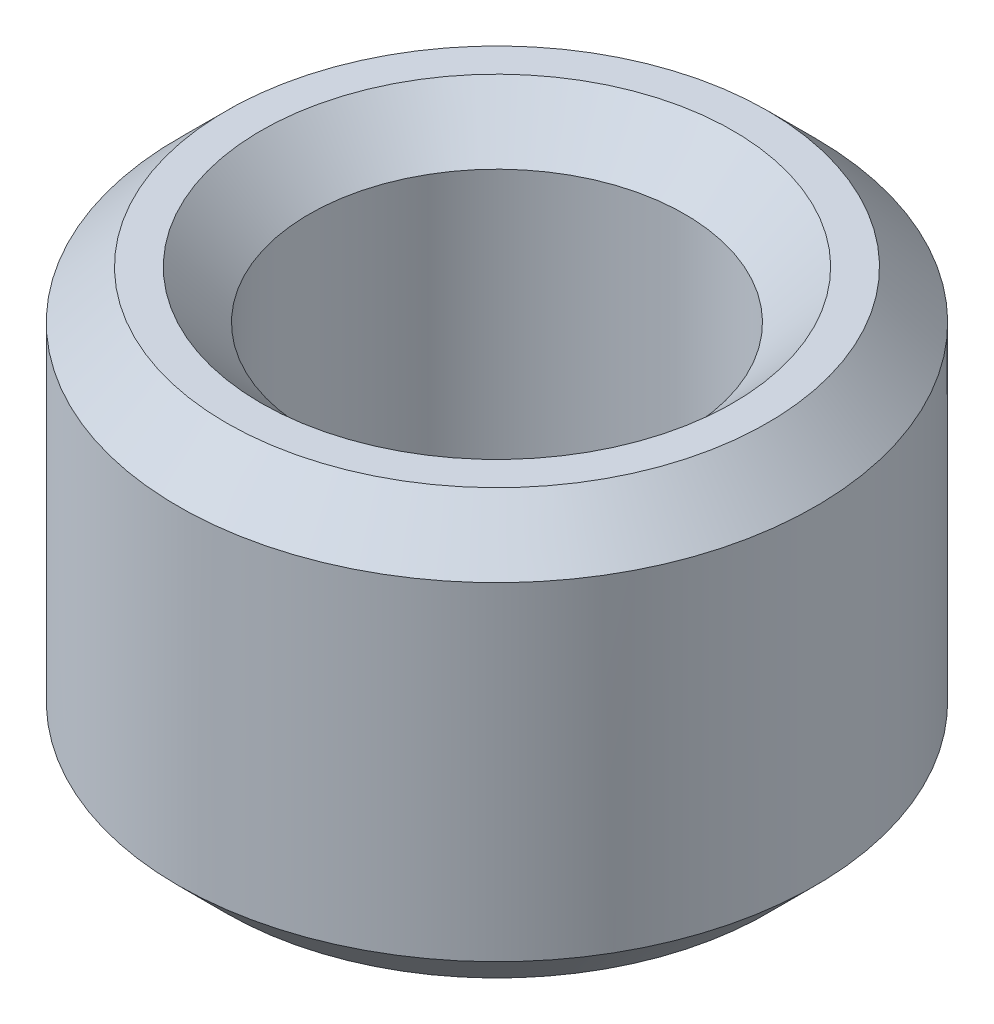
ISO-10303-21;
HEADER;
FILE_DESCRIPTION(('STEP AP214'),'2;1');
FILE_NAME('part.step','',(''),(''),'','','');
FILE_SCHEMA(('AUTOMOTIVE_DESIGN { 1 0 10303 214 1 1 1 1 }'));
ENDSEC;
DATA;
#1=APPLICATION_CONTEXT('core data for automotive mechanical design processes');
#2=APPLICATION_PROTOCOL_DEFINITION('international standard','automotive_design',2000,#1);
#3=PRODUCT_CONTEXT('',#1,'mechanical');
#4=PRODUCT('Part','Part','',(#3));
#5=PRODUCT_RELATED_PRODUCT_CATEGORY('part','',(#4));
#6=PRODUCT_DEFINITION_FORMATION('','',#4);
#7=PRODUCT_DEFINITION_CONTEXT('part definition',#1,'design');
#8=PRODUCT_DEFINITION('design','',#6,#7);
#9=PRODUCT_DEFINITION_SHAPE('','',#8);
#10=(LENGTH_UNIT() NAMED_UNIT(*) SI_UNIT(.MILLI.,.METRE.));
#11=(NAMED_UNIT(*) PLANE_ANGLE_UNIT() SI_UNIT($,.RADIAN.));
#12=(NAMED_UNIT(*) SI_UNIT($,.STERADIAN.) SOLID_ANGLE_UNIT());
#13=UNCERTAINTY_MEASURE_WITH_UNIT(LENGTH_MEASURE(1.E-05),#10,'distance_accuracy_value','');
#14=(GEOMETRIC_REPRESENTATION_CONTEXT(3) GLOBAL_UNCERTAINTY_ASSIGNED_CONTEXT((#13)) GLOBAL_UNIT_ASSIGNED_CONTEXT((#10,
#11,#12)) REPRESENTATION_CONTEXT('',''));
#15=CARTESIAN_POINT('',(0.,0.,0.));
#16=DIRECTION('',(0.,0.,1.));
#17=DIRECTION('',(1.,0.,0.));
#18=AXIS2_PLACEMENT_3D('',#15,#16,#17);
#19=CARTESIAN_POINT('',(0.,16.6556540120762,0.));
#20=DIRECTION('',(0.,-1.,0.));
#21=DIRECTION('',(0.,0.,-1.));
#22=AXIS2_PLACEMENT_3D('',#19,#20,#21);
#23=CYLINDRICAL_SURFACE('',#22,12.5);
#24=CARTESIAN_POINT('',(0.,1.89025978462281,0.));
#25=DIRECTION('',(0.,1.,0.));
#26=DIRECTION('',(0.,0.,1.));
#27=AXIS2_PLACEMENT_3D('',#24,#25,#26);
#28=CIRCLE('',#27,12.5);
#29=CARTESIAN_POINT('',(0.,1.89025978462281,12.5));
#30=VERTEX_POINT('',#29);
#31=EDGE_CURVE('E10',#30,#30,#28,.T.);
#32=ORIENTED_EDGE('',*,*,#31,.T.);
#33=EDGE_LOOP('',(#32));
#34=FACE_BOUND('',#33,.T.);
#35=CARTESIAN_POINT('',(0.,14.7653942274534,0.));
#36=DIRECTION('',(0.,1.,0.));
#37=DIRECTION('',(0.,0.,1.));
#38=AXIS2_PLACEMENT_3D('',#35,#36,#37);
#39=CIRCLE('',#38,12.5);
#40=CARTESIAN_POINT('',(0.,14.7653942274534,-12.5));
#41=VERTEX_POINT('',#40);
#42=EDGE_CURVE('E50',#41,#41,#39,.F.);
#43=ORIENTED_EDGE('',*,*,#42,.T.);
#44=EDGE_LOOP('',(#43));
#45=FACE_BOUND('',#44,.T.);
#46=ADVANCED_FACE('F39',(#34,#45),#23,.T.);
#47=CARTESIAN_POINT('',(0.,16.6556540120762,0.));
#48=DIRECTION('',(0.,1.,0.));
#49=DIRECTION('',(0.,0.,1.));
#50=AXIS2_PLACEMENT_3D('',#47,#48,#49);
#51=PLANE('',#50);
#52=CARTESIAN_POINT('',(0.,16.6556540120762,0.));
#53=DIRECTION('',(0.,1.,0.));
#54=DIRECTION('',(0.,0.,1.));
#55=AXIS2_PLACEMENT_3D('',#52,#53,#54);
#56=CIRCLE('',#55,9.25492308203139);
#57=CARTESIAN_POINT('',(0.,16.6556540120762,9.25492308203139));
#58=VERTEX_POINT('',#57);
#59=EDGE_CURVE('E58',#58,#58,#56,.F.);
#60=ORIENTED_EDGE('',*,*,#59,.T.);
#61=EDGE_LOOP('',(#60));
#62=FACE_BOUND('',#61,.T.);
#63=CARTESIAN_POINT('',(0.,16.6556540120762,0.));
#64=DIRECTION('',(0.,1.,0.));
#65=DIRECTION('',(0.,0.,1.));
#66=AXIS2_PLACEMENT_3D('',#63,#64,#65);
#67=CIRCLE('',#66,10.6097402153772);
#68=CARTESIAN_POINT('',(0.,16.6556540120762,-10.6097402153772));
#69=VERTEX_POINT('',#68);
#70=EDGE_CURVE('E61',#69,#69,#67,.T.);
#71=ORIENTED_EDGE('',*,*,#70,.T.);
#72=EDGE_LOOP('',(#71));
#73=FACE_BOUND('',#72,.T.);
#74=ADVANCED_FACE('F88',(#62,#73),#51,.T.);
#75=CARTESIAN_POINT('',(0.,0.,0.));
#76=DIRECTION('',(0.,1.,0.));
#77=DIRECTION('',(0.,0.,1.));
#78=AXIS2_PLACEMENT_3D('',#75,#76,#77);
#79=PLANE('',#78);
#80=CARTESIAN_POINT('',(0.,0.,0.));
#81=DIRECTION('',(0.,1.,0.));
#82=DIRECTION('',(0.,0.,1.));
#83=AXIS2_PLACEMENT_3D('',#80,#81,#82);
#84=CIRCLE('',#83,9.25492308203137);
#85=CARTESIAN_POINT('',(0.,0.,9.25492308203137));
#86=VERTEX_POINT('',#85);
#87=EDGE_CURVE('E51',#86,#86,#84,.T.);
#88=ORIENTED_EDGE('',*,*,#87,.T.);
#89=EDGE_LOOP('',(#88));
#90=FACE_BOUND('',#89,.T.);
#91=CARTESIAN_POINT('',(0.,0.,0.));
#92=DIRECTION('',(0.,1.,0.));
#93=DIRECTION('',(0.,0.,1.));
#94=AXIS2_PLACEMENT_3D('',#91,#92,#93);
#95=CIRCLE('',#94,10.6097402153772);
#96=CARTESIAN_POINT('',(0.,0.,10.6097402153772));
#97=VERTEX_POINT('',#96);
#98=EDGE_CURVE('E54',#97,#97,#95,.F.);
#99=ORIENTED_EDGE('',*,*,#98,.T.);
#100=EDGE_LOOP('',(#99));
#101=FACE_BOUND('',#100,.T.);
#102=ADVANCED_FACE('F83',(#90,#101),#79,.F.);
#103=CARTESIAN_POINT('',(0.,16.6556540120762,0.));
#104=DIRECTION('',(0.,-1.,0.));
#105=DIRECTION('',(0.,0.,-1.));
#106=AXIS2_PLACEMENT_3D('',#103,#104,#105);
#107=CYLINDRICAL_SURFACE('',#106,7.36466329740857);
#108=CARTESIAN_POINT('',(0.,14.7653942274534,0.));
#109=DIRECTION('',(0.,1.,0.));
#110=DIRECTION('',(0.,0.,1.));
#111=AXIS2_PLACEMENT_3D('',#108,#109,#110);
#112=CIRCLE('',#111,7.36466329740857);
#113=CARTESIAN_POINT('',(0.,14.7653942274534,7.36466329740857));
#114=VERTEX_POINT('',#113);
#115=EDGE_CURVE('E67',#114,#114,#112,.T.);
#116=ORIENTED_EDGE('',*,*,#115,.T.);
#117=EDGE_LOOP('',(#116));
#118=FACE_BOUND('',#117,.T.);
#119=CARTESIAN_POINT('',(0.,1.89025978462281,0.));
#120=DIRECTION('',(0.,1.,0.));
#121=DIRECTION('',(0.,0.,1.));
#122=AXIS2_PLACEMENT_3D('',#119,#120,#121);
#123=CIRCLE('',#122,7.36466329740857);
#124=CARTESIAN_POINT('',(0.,1.89025978462281,7.36466329740857));
#125=VERTEX_POINT('',#124);
#126=EDGE_CURVE('E69',#125,#125,#123,.F.);
#127=ORIENTED_EDGE('',*,*,#126,.T.);
#128=EDGE_LOOP('',(#127));
#129=FACE_BOUND('',#128,.T.);
#130=ADVANCED_FACE('F71',(#118,#129),#107,.F.);
#131=CARTESIAN_POINT('',(0.,14.7653942274534,0.));
#132=DIRECTION('',(0.,1.,0.));
#133=DIRECTION('',(0.,0.,1.));
#134=AXIS2_PLACEMENT_3D('',#131,#132,#133);
#135=CONICAL_SURFACE('',#134,7.36466329740857,0.785398163397452);
#136=ORIENTED_EDGE('',*,*,#59,.F.);
#137=EDGE_LOOP('',(#136));
#138=FACE_BOUND('',#137,.T.);
#139=ORIENTED_EDGE('',*,*,#115,.F.);
#140=EDGE_LOOP('',(#139));
#141=FACE_BOUND('',#140,.T.);
#142=ADVANCED_FACE('F77',(#138,#141),#135,.F.);
#143=CARTESIAN_POINT('',(0.,0.,0.));
#144=DIRECTION('',(0.,-1.,0.));
#145=DIRECTION('',(0.,0.,-1.));
#146=AXIS2_PLACEMENT_3D('',#143,#144,#145);
#147=CONICAL_SURFACE('',#146,9.25492308203137,0.785398163397444);
#148=ORIENTED_EDGE('',*,*,#126,.F.);
#149=EDGE_LOOP('',(#148));
#150=FACE_BOUND('',#149,.T.);
#151=ORIENTED_EDGE('',*,*,#87,.F.);
#152=EDGE_LOOP('',(#151));
#153=FACE_BOUND('',#152,.T.);
#154=ADVANCED_FACE('F73',(#150,#153),#147,.F.);
#155=CARTESIAN_POINT('',(0.,1.89025978462281,0.));
#156=DIRECTION('',(0.,1.,0.));
#157=DIRECTION('',(0.,0.,1.));
#158=AXIS2_PLACEMENT_3D('',#155,#156,#157);
#159=CONICAL_SURFACE('',#158,12.5,0.785398163397451);
#160=ORIENTED_EDGE('',*,*,#98,.F.);
#161=EDGE_LOOP('',(#160));
#162=FACE_BOUND('',#161,.T.);
#163=ORIENTED_EDGE('',*,*,#31,.F.);
#164=EDGE_LOOP('',(#163));
#165=FACE_BOUND('',#164,.T.);
#166=ADVANCED_FACE('F76',(#162,#165),#159,.T.);
#167=CARTESIAN_POINT('',(0.,16.6556540120762,0.));
#168=DIRECTION('',(0.,-1.,0.));
#169=DIRECTION('',(0.,0.,-1.));
#170=AXIS2_PLACEMENT_3D('',#167,#168,#169);
#171=CONICAL_SURFACE('',#170,10.6097402153772,0.785398163397446);
#172=CARTESIAN_POINT('',(0.,14.7653942274534,-12.5));
#173=CARTESIAN_POINT('',(0.,14.7850844335432,-12.4803097939102));
#174=CARTESIAN_POINT('',(0.,14.8047746396331,-12.4606195878204));
#175=CARTESIAN_POINT('',(0.,14.8441550518127,-12.4212391756407));
#176=CARTESIAN_POINT('',(0.,14.8638452579025,-12.4015489695509));
#177=CARTESIAN_POINT('',(0.,14.9032256700822,-12.3621685573713));
#178=CARTESIAN_POINT('',(0.,14.922915876172,-12.3424783512814));
#179=CARTESIAN_POINT('',(0.,14.9622962883516,-12.3030979391018));
#180=CARTESIAN_POINT('',(0.,14.9819864944414,-12.283407733012));
#181=CARTESIAN_POINT('',(0.,15.0213669066211,-12.2440273208323));
#182=CARTESIAN_POINT('',(0.,15.0410571127109,-12.2243371147425));
#183=CARTESIAN_POINT('',(0.,15.0804375248906,-12.1849567025629));
#184=CARTESIAN_POINT('',(0.,15.1001277309804,-12.165266496473));
#185=CARTESIAN_POINT('',(0.,15.13950814316,-12.1258860842934));
#186=CARTESIAN_POINT('',(0.,15.1591983492498,-12.1061958782036));
#187=CARTESIAN_POINT('',(0.,15.1985787614295,-12.0668154660239));
#188=CARTESIAN_POINT('',(0.,15.2182689675193,-12.0471252599341));
#189=CARTESIAN_POINT('',(0.,15.2576493796989,-12.0077448477545));
#190=CARTESIAN_POINT('',(0.,15.2773395857888,-11.9880546416647));
#191=CARTESIAN_POINT('',(0.,15.3167199979684,-11.948674229485));
#192=CARTESIAN_POINT('',(0.,15.3364102040582,-11.9289840233952));
#193=CARTESIAN_POINT('',(0.,15.3757906162379,-11.8896036112156));
#194=CARTESIAN_POINT('',(0.,15.3954808223277,-11.8699134051257));
#195=CARTESIAN_POINT('',(0.,15.4348612345073,-11.8305329929461));
#196=CARTESIAN_POINT('',(0.,15.4545514405971,-11.8108427868563));
#197=CARTESIAN_POINT('',(0.,15.4939318527768,-11.7714623746766));
#198=CARTESIAN_POINT('',(0.,15.5136220588666,-11.7517721685868));
#199=CARTESIAN_POINT('',(0.,15.5530024710463,-11.7123917564072));
#200=CARTESIAN_POINT('',(0.,15.5726926771361,-11.6927015503173));
#201=CARTESIAN_POINT('',(0.,15.6120730893157,-11.6533211381377));
#202=CARTESIAN_POINT('',(0.,15.6317632954055,-11.6336309320479));
#203=CARTESIAN_POINT('',(0.,15.6711437075852,-11.5942505198682));
#204=CARTESIAN_POINT('',(0.,15.690833913675,-11.5745603137784));
#205=CARTESIAN_POINT('',(0.,15.7302143258546,-11.5351799015988));
#206=CARTESIAN_POINT('',(0.,15.7499045319445,-11.515489695509));
#207=CARTESIAN_POINT('',(0.,15.7892849441241,-11.4761092833293));
#208=CARTESIAN_POINT('',(0.,15.8089751502139,-11.4564190772395));
#209=CARTESIAN_POINT('',(0.,15.8483555623936,-11.4170386650599));
#210=CARTESIAN_POINT('',(0.,15.8680457684834,-11.39734845897));
#211=CARTESIAN_POINT('',(0.,15.907426180663,-11.3579680467904));
#212=CARTESIAN_POINT('',(0.,15.9271163867529,-11.3382778407006));
#213=CARTESIAN_POINT('',(0.,15.9664967989325,-11.2988974285209));
#214=CARTESIAN_POINT('',(0.,15.9861870050223,-11.2792072224311));
#215=CARTESIAN_POINT('',(0.,16.025567417202,-11.2398268102515));
#216=CARTESIAN_POINT('',(0.,16.0452576232918,-11.2201366041616));
#217=CARTESIAN_POINT('',(0.,16.0846380354714,-11.180756191982));
#218=CARTESIAN_POINT('',(0.,16.1043282415612,-11.1610659858922));
#219=CARTESIAN_POINT('',(0.,16.1437086537409,-11.1216855737125));
#220=CARTESIAN_POINT('',(0.,16.1633988598307,-11.1019953676227));
#221=CARTESIAN_POINT('',(0.,16.2027792720103,-11.0626149554431));
#222=CARTESIAN_POINT('',(0.,16.2224694781002,-11.0429247493533));
#223=CARTESIAN_POINT('',(0.,16.2618498902798,-11.0035443371736));
#224=CARTESIAN_POINT('',(0.,16.2815400963696,-10.9838541310838));
#225=CARTESIAN_POINT('',(0.,16.3209205085493,-10.9444737189041));
#226=CARTESIAN_POINT('',(0.,16.3406107146391,-10.9247835128143));
#227=CARTESIAN_POINT('',(0.,16.3799911268187,-10.8854031006347));
#228=CARTESIAN_POINT('',(0.,16.3996813329086,-10.8657128945449));
#229=CARTESIAN_POINT('',(0.,16.4390617450882,-10.8263324823652));
#230=CARTESIAN_POINT('',(0.,16.458751951178,-10.8066422762754));
#231=CARTESIAN_POINT('',(0.,16.4981323633577,-10.7672618640958));
#232=CARTESIAN_POINT('',(0.,16.5178225694475,-10.7475716580059));
#233=CARTESIAN_POINT('',(0.,16.5572029816271,-10.7081912458263));
#234=CARTESIAN_POINT('',(0.,16.5768931877169,-10.6885010397365));
#235=CARTESIAN_POINT('',(0.,16.6162735998966,-10.6491206275568));
#236=CARTESIAN_POINT('',(0.,16.6359638059864,-10.629430421467));
#237=CARTESIAN_POINT('',(0.,16.6556540120762,-10.6097402153772));
#238=B_SPLINE_CURVE_WITH_KNOTS('',3,(#172,#173,#174,#175,#176,#177,#178,#179,#180,#181,#182,
#183,#184,#185,#186,#187,#188,#189,#190,#191,#192,#193,#194,#195,#196,#197,#198,#199,#200,#201,
#202,#203,#204,#205,#206,#207,#208,#209,#210,#211,#212,#213,#214,#215,#216,#217,#218,#219,#220,
#221,#222,#223,#224,#225,#226,#227,#228,#229,#230,#231,#232,#233,#234,#235,#236,#237),
.UNSPECIFIED.,.F.,.F.,(4,2,2,2,2,2,2,2,2,2,2,2,2,2,2,2,2,2,2,2,2,2,2,2,2,2,2,2,2,2,2,2,4),(0.,
0.0835384694944385,0.167076938988877,0.250615408483316,0.334153877977754,0.417692347472193,
0.50123081696663,0.584769286461069,0.668307755955507,0.751846225449946,0.835384694944384,
0.918923164438823,1.00246163393326,1.0860001034277,1.16953857292214,1.25307704241658,
1.33661551191101,1.42015398140545,1.50369245089989,1.58723092039433,1.67076938988877,
1.75430785938321,1.83784632887764,1.92138479837208,2.00492326786652,2.08846173736096,
2.1720002068554,2.25553867634984,2.33907714584427,2.42261561533871,2.50615408483315,
2.58969255432759,2.67323102382203),.UNSPECIFIED.);
#239=EDGE_CURVE('BSEAM45',#41,#69,#238,.T.);
#240=ORIENTED_EDGE('',*,*,#42,.F.);
#241=ORIENTED_EDGE('',*,*,#70,.F.);
#242=ORIENTED_EDGE('',*,*,#239,.T.);
#243=ORIENTED_EDGE('',*,*,#239,.F.);
#244=EDGE_LOOP('',(#240,#242,#241,#243));
#245=FACE_BOUND('',#244,.T.);
#246=ADVANCED_FACE('F45',(#245),#171,.T.);
#247=CLOSED_SHELL('',(#46,#74,#102,#130,#142,#154,#166,#246));
#248=MANIFOLD_SOLID_BREP('B2',#247);
#249=ADVANCED_BREP_SHAPE_REPRESENTATION('',(#18,#248),#14);
#250=SHAPE_DEFINITION_REPRESENTATION(#9,#249);
ENDSEC;
END-ISO-10303-21;
